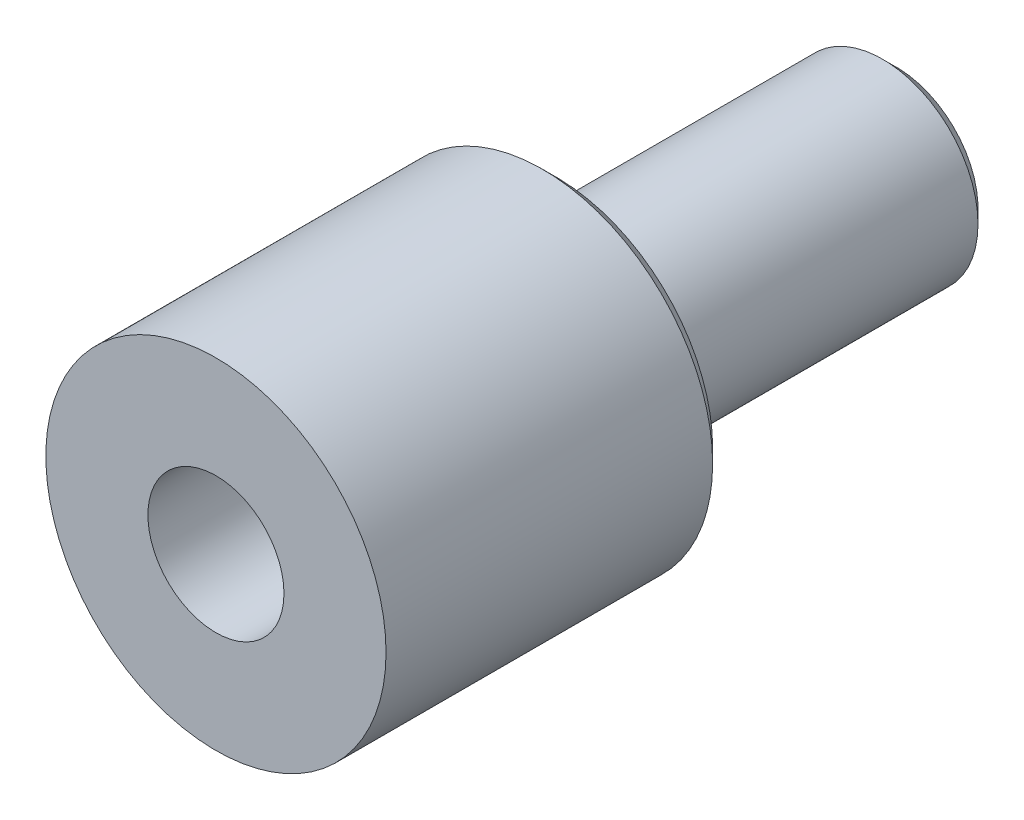
ISO-10303-21;
HEADER;
FILE_DESCRIPTION(('STEP AP214'),'2;1');
FILE_NAME('part.step','',(''),(''),'','','');
FILE_SCHEMA(('AUTOMOTIVE_DESIGN { 1 0 10303 214 1 1 1 1 }'));
ENDSEC;
DATA;
#1=APPLICATION_CONTEXT('core data for automotive mechanical design processes');
#2=APPLICATION_PROTOCOL_DEFINITION('international standard','automotive_design',2000,#1);
#3=PRODUCT_CONTEXT('',#1,'mechanical');
#4=PRODUCT('Part','Part','',(#3));
#5=PRODUCT_RELATED_PRODUCT_CATEGORY('part','',(#4));
#6=PRODUCT_DEFINITION_FORMATION('','',#4);
#7=PRODUCT_DEFINITION_CONTEXT('part definition',#1,'design');
#8=PRODUCT_DEFINITION('design','',#6,#7);
#9=PRODUCT_DEFINITION_SHAPE('','',#8);
#10=(LENGTH_UNIT() NAMED_UNIT(*) SI_UNIT(.MILLI.,.METRE.));
#11=(NAMED_UNIT(*) PLANE_ANGLE_UNIT() SI_UNIT($,.RADIAN.));
#12=(NAMED_UNIT(*) SI_UNIT($,.STERADIAN.) SOLID_ANGLE_UNIT());
#13=UNCERTAINTY_MEASURE_WITH_UNIT(LENGTH_MEASURE(1.E-05),#10,'distance_accuracy_value','');
#14=(GEOMETRIC_REPRESENTATION_CONTEXT(3) GLOBAL_UNCERTAINTY_ASSIGNED_CONTEXT((#13)) GLOBAL_UNIT_ASSIGNED_CONTEXT((#10,
#11,#12)) REPRESENTATION_CONTEXT('',''));
#15=CARTESIAN_POINT('',(0.,0.,0.));
#16=DIRECTION('',(0.,0.,1.));
#17=DIRECTION('',(1.,0.,0.));
#18=AXIS2_PLACEMENT_3D('',#15,#16,#17);
#19=CARTESIAN_POINT('',(0.,0.,25.));
#20=DIRECTION('',(0.,0.,1.));
#21=DIRECTION('',(1.,0.,0.));
#22=AXIS2_PLACEMENT_3D('',#19,#20,#21);
#23=PLANE('',#22);
#24=CARTESIAN_POINT('',(0.,0.,25.));
#25=DIRECTION('',(0.,0.,1.));
#26=DIRECTION('',(1.,0.,0.));
#27=AXIS2_PLACEMENT_3D('',#24,#25,#26);
#28=CIRCLE('',#27,12.5);
#29=CARTESIAN_POINT('',(12.5,0.,25.));
#30=VERTEX_POINT('',#29);
#31=EDGE_CURVE('E61',#30,#30,#28,.T.);
#32=ORIENTED_EDGE('',*,*,#31,.T.);
#33=EDGE_LOOP('',(#32));
#34=FACE_BOUND('',#33,.T.);
#35=CARTESIAN_POINT('',(0.,0.,25.));
#36=DIRECTION('',(0.,0.,1.));
#37=DIRECTION('',(1.,0.,0.));
#38=AXIS2_PLACEMENT_3D('',#35,#36,#37);
#39=CIRCLE('',#38,5.);
#40=CARTESIAN_POINT('',(5.,0.,25.));
#41=VERTEX_POINT('',#40);
#42=EDGE_CURVE('E64',#41,#41,#39,.T.);
#43=ORIENTED_EDGE('',*,*,#42,.F.);
#44=EDGE_LOOP('',(#43));
#45=FACE_BOUND('',#44,.T.);
#46=ADVANCED_FACE('F38',(#34,#45),#23,.T.);
#47=CARTESIAN_POINT('',(0.,0.,0.));
#48=DIRECTION('',(0.,0.,1.));
#49=DIRECTION('',(1.,0.,0.));
#50=AXIS2_PLACEMENT_3D('',#47,#48,#49);
#51=PLANE('',#50);
#52=CARTESIAN_POINT('',(0.,0.,0.));
#53=DIRECTION('',(0.,0.,1.));
#54=DIRECTION('',(1.,0.,0.));
#55=AXIS2_PLACEMENT_3D('',#52,#53,#54);
#56=CIRCLE('',#55,11.5);
#57=CARTESIAN_POINT('',(11.5,0.,0.));
#58=VERTEX_POINT('',#57);
#59=EDGE_CURVE('E49',#58,#58,#56,.F.);
#60=ORIENTED_EDGE('',*,*,#59,.T.);
#61=EDGE_LOOP('',(#60));
#62=FACE_BOUND('',#61,.T.);
#63=CARTESIAN_POINT('',(0.,0.,0.));
#64=DIRECTION('',(0.,0.,1.));
#65=DIRECTION('',(1.,0.,0.));
#66=AXIS2_PLACEMENT_3D('',#63,#64,#65);
#67=CIRCLE('',#66,7.);
#68=CARTESIAN_POINT('',(7.,0.,0.));
#69=VERTEX_POINT('',#68);
#70=EDGE_CURVE('E58',#69,#69,#67,.F.);
#71=ORIENTED_EDGE('',*,*,#70,.F.);
#72=EDGE_LOOP('',(#71));
#73=FACE_BOUND('',#72,.T.);
#74=ADVANCED_FACE('F75',(#62,#73),#51,.F.);
#75=CARTESIAN_POINT('',(0.,0.,25.));
#76=DIRECTION('',(0.,0.,-1.));
#77=DIRECTION('',(-1.,0.,0.));
#78=AXIS2_PLACEMENT_3D('',#75,#76,#77);
#79=CYLINDRICAL_SURFACE('',#78,12.5);
#80=CARTESIAN_POINT('',(0.,0.,1.));
#81=DIRECTION('',(0.,0.,1.));
#82=DIRECTION('',(1.,0.,0.));
#83=AXIS2_PLACEMENT_3D('',#80,#81,#82);
#84=CIRCLE('',#83,12.5);
#85=CARTESIAN_POINT('',(12.5,0.,1.));
#86=VERTEX_POINT('',#85);
#87=EDGE_CURVE('E53',#86,#86,#84,.T.);
#88=ORIENTED_EDGE('',*,*,#87,.T.);
#89=EDGE_LOOP('',(#88));
#90=FACE_BOUND('',#89,.T.);
#91=ORIENTED_EDGE('',*,*,#31,.F.);
#92=EDGE_LOOP('',(#91));
#93=FACE_BOUND('',#92,.T.);
#94=ADVANCED_FACE('F81',(#90,#93),#79,.T.);
#95=CARTESIAN_POINT('',(0.,0.,25.));
#96=DIRECTION('',(0.,0.,-1.));
#97=DIRECTION('',(-1.,0.,0.));
#98=AXIS2_PLACEMENT_3D('',#95,#96,#97);
#99=CYLINDRICAL_SURFACE('',#98,5.);
#100=ORIENTED_EDGE('',*,*,#42,.T.);
#101=EDGE_LOOP('',(#100));
#102=FACE_BOUND('',#101,.T.);
#103=CARTESIAN_POINT('',(0.,0.,0.));
#104=DIRECTION('',(0.,0.,1.));
#105=DIRECTION('',(1.,0.,0.));
#106=AXIS2_PLACEMENT_3D('',#103,#104,#105);
#107=CIRCLE('',#106,5.);
#108=CARTESIAN_POINT('',(5.,0.,0.));
#109=VERTEX_POINT('',#108);
#110=EDGE_CURVE('E65',#109,#109,#107,.T.);
#111=ORIENTED_EDGE('',*,*,#110,.F.);
#112=EDGE_LOOP('',(#111));
#113=FACE_BOUND('',#112,.T.);
#114=ADVANCED_FACE('F71',(#102,#113),#99,.F.);
#115=CARTESIAN_POINT('',(0.,0.,0.));
#116=DIRECTION('',(0.,0.,-1.));
#117=DIRECTION('',(-1.,0.,0.));
#118=AXIS2_PLACEMENT_3D('',#115,#116,#117);
#119=PLANE('',#118);
#120=ORIENTED_EDGE('',*,*,#110,.T.);
#121=EDGE_LOOP('',(#120));
#122=FACE_BOUND('',#121,.T.);
#123=ADVANCED_FACE('F109',(#122),#119,.F.);
#124=CARTESIAN_POINT('',(0.,0.,-25.));
#125=DIRECTION('',(0.,0.,1.));
#126=DIRECTION('',(1.,0.,0.));
#127=AXIS2_PLACEMENT_3D('',#124,#125,#126);
#128=CYLINDRICAL_SURFACE('',#127,7.);
#129=CARTESIAN_POINT('',(0.,0.,-24.));
#130=DIRECTION('',(0.,0.,-1.));
#131=DIRECTION('',(-1.,0.,0.));
#132=AXIS2_PLACEMENT_3D('',#129,#130,#131);
#133=CIRCLE('',#132,7.);
#134=CARTESIAN_POINT('',(-7.,0.,-24.));
#135=VERTEX_POINT('',#134);
#136=EDGE_CURVE('E10',#135,#135,#133,.F.);
#137=ORIENTED_EDGE('',*,*,#136,.T.);
#138=EDGE_LOOP('',(#137));
#139=FACE_BOUND('',#138,.T.);
#140=ORIENTED_EDGE('',*,*,#70,.T.);
#141=EDGE_LOOP('',(#140));
#142=FACE_BOUND('',#141,.T.);
#143=ADVANCED_FACE('F98',(#139,#142),#128,.T.);
#144=CARTESIAN_POINT('',(0.,0.,-25.));
#145=DIRECTION('',(0.,0.,-1.));
#146=DIRECTION('',(-1.,0.,0.));
#147=AXIS2_PLACEMENT_3D('',#144,#145,#146);
#148=PLANE('',#147);
#149=CARTESIAN_POINT('',(0.,0.,-25.));
#150=DIRECTION('',(0.,0.,-1.));
#151=DIRECTION('',(-1.,0.,0.));
#152=AXIS2_PLACEMENT_3D('',#149,#150,#151);
#153=CIRCLE('',#152,6.);
#154=CARTESIAN_POINT('',(-6.,0.,-25.));
#155=VERTEX_POINT('',#154);
#156=EDGE_CURVE('E45',#155,#155,#153,.T.);
#157=ORIENTED_EDGE('',*,*,#156,.T.);
#158=EDGE_LOOP('',(#157));
#159=FACE_BOUND('',#158,.T.);
#160=ADVANCED_FACE('F91',(#159),#148,.T.);
#161=CARTESIAN_POINT('',(0.,0.,1.));
#162=DIRECTION('',(0.,0.,1.));
#163=DIRECTION('',(1.,0.,0.));
#164=AXIS2_PLACEMENT_3D('',#161,#162,#163);
#165=CONICAL_SURFACE('',#164,12.5,0.78539816339745);
#166=ORIENTED_EDGE('',*,*,#59,.F.);
#167=EDGE_LOOP('',(#166));
#168=FACE_BOUND('',#167,.T.);
#169=ORIENTED_EDGE('',*,*,#87,.F.);
#170=EDGE_LOOP('',(#169));
#171=FACE_BOUND('',#170,.T.);
#172=ADVANCED_FACE('F89',(#168,#171),#165,.T.);
#173=CARTESIAN_POINT('',(0.,0.,-25.));
#174=DIRECTION('',(0.,0.,1.));
#175=DIRECTION('',(1.,0.,0.));
#176=AXIS2_PLACEMENT_3D('',#173,#174,#175);
#177=CONICAL_SURFACE('',#176,6.,0.785398163397447);
#178=ORIENTED_EDGE('',*,*,#136,.F.);
#179=EDGE_LOOP('',(#178));
#180=FACE_BOUND('',#179,.T.);
#181=ORIENTED_EDGE('',*,*,#156,.F.);
#182=EDGE_LOOP('',(#181));
#183=FACE_BOUND('',#182,.T.);
#184=ADVANCED_FACE('F40',(#180,#183),#177,.T.);
#185=CLOSED_SHELL('',(#46,#74,#94,#114,#123,#143,#160,#172,#184));
#186=MANIFOLD_SOLID_BREP('B2',#185);
#187=ADVANCED_BREP_SHAPE_REPRESENTATION('',(#18,#186),#14);
#188=SHAPE_DEFINITION_REPRESENTATION(#9,#187);
ENDSEC;
END-ISO-10303-21;
